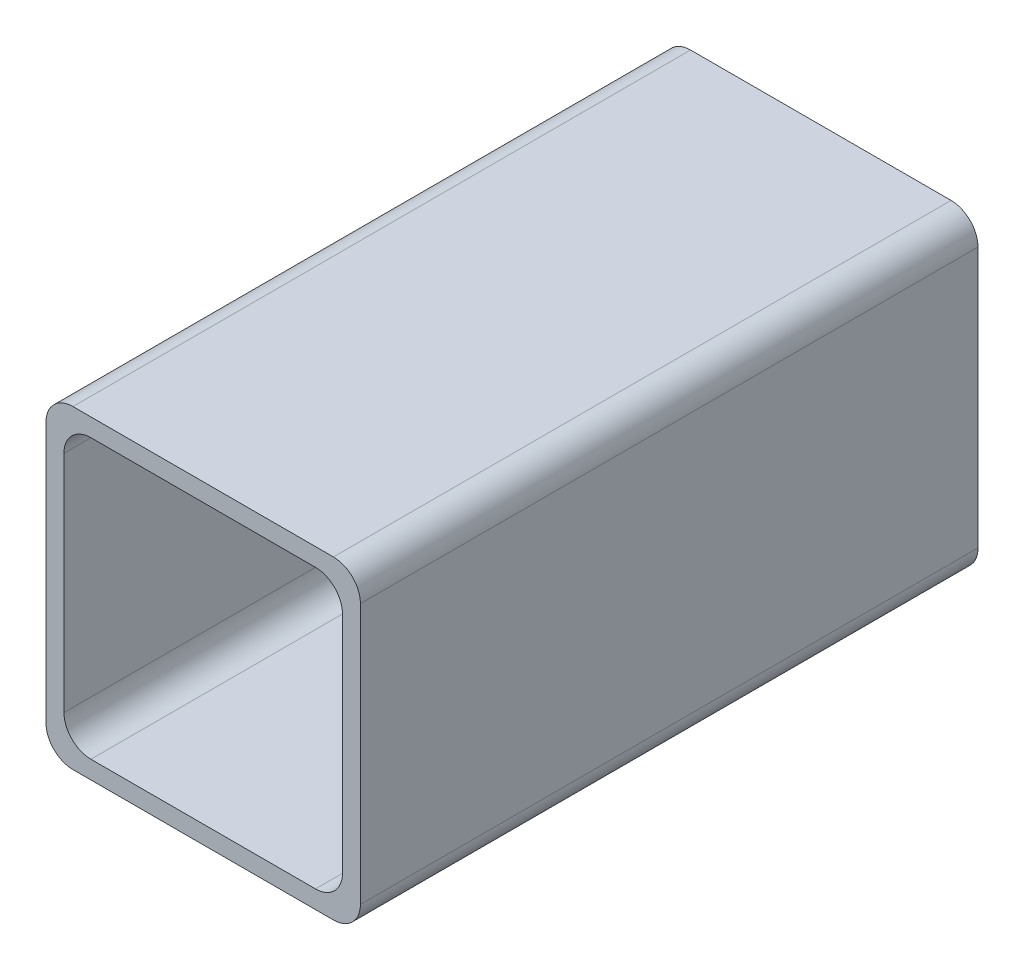
ISO-10303-21;
HEADER;
FILE_DESCRIPTION(('STEP AP214'),'2;1');
FILE_NAME('part.step','',(''),(''),'','','');
FILE_SCHEMA(('AUTOMOTIVE_DESIGN { 1 0 10303 214 1 1 1 1 }'));
ENDSEC;
DATA;
#1=APPLICATION_CONTEXT('core data for automotive mechanical design processes');
#2=APPLICATION_PROTOCOL_DEFINITION('international standard','automotive_design',2000,#1);
#3=PRODUCT_CONTEXT('',#1,'mechanical');
#4=PRODUCT('Part','Part','',(#3));
#5=PRODUCT_RELATED_PRODUCT_CATEGORY('part','',(#4));
#6=PRODUCT_DEFINITION_FORMATION('','',#4);
#7=PRODUCT_DEFINITION_CONTEXT('part definition',#1,'design');
#8=PRODUCT_DEFINITION('design','',#6,#7);
#9=PRODUCT_DEFINITION_SHAPE('','',#8);
#10=(LENGTH_UNIT() NAMED_UNIT(*) SI_UNIT(.MILLI.,.METRE.));
#11=(NAMED_UNIT(*) PLANE_ANGLE_UNIT() SI_UNIT($,.RADIAN.));
#12=(NAMED_UNIT(*) SI_UNIT($,.STERADIAN.) SOLID_ANGLE_UNIT());
#13=UNCERTAINTY_MEASURE_WITH_UNIT(LENGTH_MEASURE(1.E-05),#10,'distance_accuracy_value','');
#14=(GEOMETRIC_REPRESENTATION_CONTEXT(3) GLOBAL_UNCERTAINTY_ASSIGNED_CONTEXT((#13)) GLOBAL_UNIT_ASSIGNED_CONTEXT((#10,
#11,#12)) REPRESENTATION_CONTEXT('',''));
#15=CARTESIAN_POINT('',(0.,0.,0.));
#16=DIRECTION('',(0.,0.,1.));
#17=DIRECTION('',(1.,0.,0.));
#18=AXIS2_PLACEMENT_3D('',#15,#16,#17);
#19=CARTESIAN_POINT('',(-17.5,14.5000000000001,118.247474683058));
#20=DIRECTION('',(1.,0.,0.));
#21=DIRECTION('',(0.,0.,-1.));
#22=AXIS2_PLACEMENT_3D('',#19,#20,#21);
#23=PLANE('',#22);
#24=DIRECTION('',(0.,-1.,0.));
#25=VECTOR('',#24,1.);
#26=CARTESIAN_POINT('',(-17.5,14.5000000000002,68.7499999999999));
#27=LINE('',#26,#25);
#28=CARTESIAN_POINT('',(-17.5,14.5000000000002,68.7499999999999));
#29=VERTEX_POINT('',#28);
#30=CARTESIAN_POINT('',(-17.5,-14.4999999999998,68.7499999999999));
#31=VERTEX_POINT('',#30);
#32=EDGE_CURVE('E303',#29,#31,#27,.T.);
#33=ORIENTED_EDGE('',*,*,#32,.F.);
#34=DIRECTION('',(0.,0.,-1.));
#35=VECTOR('',#34,1.);
#36=CARTESIAN_POINT('',(-17.5,14.5000000000001,118.247474683058));
#37=LINE('',#36,#35);
#38=CARTESIAN_POINT('',(-17.5,14.5,0.));
#39=VERTEX_POINT('',#38);
#40=EDGE_CURVE('E47',#29,#39,#37,.T.);
#41=ORIENTED_EDGE('',*,*,#40,.T.);
#42=DIRECTION('',(0.,-1.,0.));
#43=VECTOR('',#42,1.);
#44=CARTESIAN_POINT('',(-17.5,14.5,0.));
#45=LINE('',#44,#43);
#46=CARTESIAN_POINT('',(-17.5,-14.5,0.));
#47=VERTEX_POINT('',#46);
#48=EDGE_CURVE('E198',#39,#47,#45,.T.);
#49=ORIENTED_EDGE('',*,*,#48,.T.);
#50=DIRECTION('',(0.,0.,-1.));
#51=VECTOR('',#50,1.);
#52=CARTESIAN_POINT('',(-17.5,-14.4999999999999,118.247474683058));
#53=LINE('',#52,#51);
#54=EDGE_CURVE('E201',#31,#47,#53,.T.);
#55=ORIENTED_EDGE('',*,*,#54,.F.);
#56=EDGE_LOOP('',(#33,#41,#49,#55));
#57=FACE_BOUND('',#56,.T.);
#58=ADVANCED_FACE('F32',(#57),#23,.F.);
#59=CARTESIAN_POINT('',(-14.5,14.5000000000001,118.247474683058));
#60=DIRECTION('',(0.,0.,-1.));
#61=DIRECTION('',(-1.,0.,0.));
#62=AXIS2_PLACEMENT_3D('',#59,#60,#61);
#63=CYLINDRICAL_SURFACE('',#62,3.);
#64=CARTESIAN_POINT('',(-14.5,14.5000000000002,68.7499999999999));
#65=DIRECTION('',(0.,0.,1.));
#66=DIRECTION('',(1.,0.,0.));
#67=AXIS2_PLACEMENT_3D('',#64,#65,#66);
#68=CIRCLE('',#67,3.);
#69=CARTESIAN_POINT('',(-14.5000000000002,17.5000000000002,68.7499999999999));
#70=VERTEX_POINT('',#69);
#71=EDGE_CURVE('E239',#70,#29,#68,.T.);
#72=ORIENTED_EDGE('',*,*,#71,.F.);
#73=DIRECTION('',(0.,0.,-1.));
#74=VECTOR('',#73,1.);
#75=CARTESIAN_POINT('',(-14.5000000000002,17.5000000000001,118.247474683058));
#76=LINE('',#75,#74);
#77=CARTESIAN_POINT('',(-14.5000000000002,17.5,0.));
#78=VERTEX_POINT('',#77);
#79=EDGE_CURVE('E204',#70,#78,#76,.T.);
#80=ORIENTED_EDGE('',*,*,#79,.T.);
#81=CARTESIAN_POINT('',(-14.5,14.5,0.));
#82=DIRECTION('',(0.,0.,1.));
#83=DIRECTION('',(1.,0.,0.));
#84=AXIS2_PLACEMENT_3D('',#81,#82,#83);
#85=CIRCLE('',#84,3.);
#86=EDGE_CURVE('E196',#78,#39,#85,.T.);
#87=ORIENTED_EDGE('',*,*,#86,.T.);
#88=ORIENTED_EDGE('',*,*,#40,.F.);
#89=EDGE_LOOP('',(#72,#80,#87,#88));
#90=FACE_BOUND('',#89,.T.);
#91=ADVANCED_FACE('F236',(#90),#63,.T.);
#92=CARTESIAN_POINT('',(14.4999999999998,17.5000000000001,118.247474683058));
#93=DIRECTION('',(0.,-1.,0.));
#94=DIRECTION('',(0.,0.,-1.));
#95=AXIS2_PLACEMENT_3D('',#92,#93,#94);
#96=PLANE('',#95);
#97=DIRECTION('',(-1.,0.,0.));
#98=VECTOR('',#97,1.);
#99=CARTESIAN_POINT('',(14.5,17.5000000000002,68.7499999999999));
#100=LINE('',#99,#98);
#101=CARTESIAN_POINT('',(14.5,17.5000000000002,68.7499999999999));
#102=VERTEX_POINT('',#101);
#103=EDGE_CURVE('E244',#102,#70,#100,.T.);
#104=ORIENTED_EDGE('',*,*,#103,.F.);
#105=DIRECTION('',(0.,0.,-1.));
#106=VECTOR('',#105,1.);
#107=CARTESIAN_POINT('',(14.4999999999998,17.5000000000001,118.247474683058));
#108=LINE('',#107,#106);
#109=CARTESIAN_POINT('',(14.4999999999998,17.5,0.));
#110=VERTEX_POINT('',#109);
#111=EDGE_CURVE('E206',#102,#110,#108,.T.);
#112=ORIENTED_EDGE('',*,*,#111,.T.);
#113=DIRECTION('',(-1.,0.,0.));
#114=VECTOR('',#113,1.);
#115=CARTESIAN_POINT('',(14.4999999999998,17.5,0.));
#116=LINE('',#115,#114);
#117=EDGE_CURVE('E193',#110,#78,#116,.T.);
#118=ORIENTED_EDGE('',*,*,#117,.T.);
#119=ORIENTED_EDGE('',*,*,#79,.F.);
#120=EDGE_LOOP('',(#104,#112,#118,#119));
#121=FACE_BOUND('',#120,.T.);
#122=ADVANCED_FACE('F242',(#121),#96,.F.);
#123=CARTESIAN_POINT('',(14.5,14.5000000000001,118.247474683058));
#124=DIRECTION('',(0.,0.,-1.));
#125=DIRECTION('',(-1.,0.,0.));
#126=AXIS2_PLACEMENT_3D('',#123,#124,#125);
#127=CYLINDRICAL_SURFACE('',#126,3.);
#128=CARTESIAN_POINT('',(14.5000000000001,14.5000000000002,68.7499999999999));
#129=DIRECTION('',(0.,0.,1.));
#130=DIRECTION('',(1.,0.,0.));
#131=AXIS2_PLACEMENT_3D('',#128,#129,#130);
#132=CIRCLE('',#131,3.);
#133=CARTESIAN_POINT('',(17.5000000000001,14.5000000000002,68.7499999999999));
#134=VERTEX_POINT('',#133);
#135=EDGE_CURVE('E307',#134,#102,#132,.T.);
#136=ORIENTED_EDGE('',*,*,#135,.F.);
#137=DIRECTION('',(0.,0.,-1.));
#138=VECTOR('',#137,1.);
#139=CARTESIAN_POINT('',(17.5,14.5000000000001,118.247474683058));
#140=LINE('',#139,#138);
#141=CARTESIAN_POINT('',(17.5,14.5,0.));
#142=VERTEX_POINT('',#141);
#143=EDGE_CURVE('E208',#134,#142,#140,.T.);
#144=ORIENTED_EDGE('',*,*,#143,.T.);
#145=CARTESIAN_POINT('',(14.5,14.5,0.));
#146=DIRECTION('',(0.,0.,1.));
#147=DIRECTION('',(-1.,0.,0.));
#148=AXIS2_PLACEMENT_3D('',#145,#146,#147);
#149=CIRCLE('',#148,3.);
#150=EDGE_CURVE('E190',#142,#110,#149,.T.);
#151=ORIENTED_EDGE('',*,*,#150,.T.);
#152=ORIENTED_EDGE('',*,*,#111,.F.);
#153=EDGE_LOOP('',(#136,#144,#151,#152));
#154=FACE_BOUND('',#153,.T.);
#155=ADVANCED_FACE('F247',(#154),#127,.T.);
#156=CARTESIAN_POINT('',(17.5,14.5000000000001,118.247474683058));
#157=DIRECTION('',(-1.,0.,0.));
#158=DIRECTION('',(0.,0.,1.));
#159=AXIS2_PLACEMENT_3D('',#156,#157,#158);
#160=PLANE('',#159);
#161=DIRECTION('',(0.,1.,0.));
#162=VECTOR('',#161,1.);
#163=CARTESIAN_POINT('',(17.5000000000001,14.5000000000002,68.7499999999999));
#164=LINE('',#163,#162);
#165=CARTESIAN_POINT('',(17.5000000000001,-14.4999999999998,68.7499999999999));
#166=VERTEX_POINT('',#165);
#167=EDGE_CURVE('E253',#166,#134,#164,.T.);
#168=ORIENTED_EDGE('',*,*,#167,.F.);
#169=DIRECTION('',(0.,0.,-1.));
#170=VECTOR('',#169,1.);
#171=CARTESIAN_POINT('',(17.5,-14.5,118.247474683058));
#172=LINE('',#171,#170);
#173=CARTESIAN_POINT('',(17.5,-14.5,0.));
#174=VERTEX_POINT('',#173);
#175=EDGE_CURVE('E210',#166,#174,#172,.T.);
#176=ORIENTED_EDGE('',*,*,#175,.T.);
#177=DIRECTION('',(0.,1.,0.));
#178=VECTOR('',#177,1.);
#179=CARTESIAN_POINT('',(17.5,14.5,0.));
#180=LINE('',#179,#178);
#181=EDGE_CURVE('E187',#174,#142,#180,.T.);
#182=ORIENTED_EDGE('',*,*,#181,.T.);
#183=ORIENTED_EDGE('',*,*,#143,.F.);
#184=EDGE_LOOP('',(#168,#176,#182,#183));
#185=FACE_BOUND('',#184,.T.);
#186=ADVANCED_FACE('F250',(#185),#160,.F.);
#187=CARTESIAN_POINT('',(14.5,-14.5,118.247474683058));
#188=DIRECTION('',(0.,0.,-1.));
#189=DIRECTION('',(-1.,0.,0.));
#190=AXIS2_PLACEMENT_3D('',#187,#188,#189);
#191=CYLINDRICAL_SURFACE('',#190,3.);
#192=CARTESIAN_POINT('',(14.5,-14.4999999999998,68.7499999999999));
#193=DIRECTION('',(0.,0.,1.));
#194=DIRECTION('',(1.,0.,0.));
#195=AXIS2_PLACEMENT_3D('',#192,#193,#194);
#196=CIRCLE('',#195,3.);
#197=CARTESIAN_POINT('',(14.5,-17.4999999999998,68.7499999999999));
#198=VERTEX_POINT('',#197);
#199=EDGE_CURVE('E257',#198,#166,#196,.T.);
#200=ORIENTED_EDGE('',*,*,#199,.F.);
#201=DIRECTION('',(0.,0.,-1.));
#202=VECTOR('',#201,1.);
#203=CARTESIAN_POINT('',(14.5,-17.5,118.247474683058));
#204=LINE('',#203,#202);
#205=CARTESIAN_POINT('',(14.5,-17.5,0.));
#206=VERTEX_POINT('',#205);
#207=EDGE_CURVE('E212',#198,#206,#204,.T.);
#208=ORIENTED_EDGE('',*,*,#207,.T.);
#209=CARTESIAN_POINT('',(14.5,-14.5,0.));
#210=DIRECTION('',(0.,0.,1.));
#211=DIRECTION('',(1.,0.,0.));
#212=AXIS2_PLACEMENT_3D('',#209,#210,#211);
#213=CIRCLE('',#212,3.);
#214=EDGE_CURVE('E184',#206,#174,#213,.T.);
#215=ORIENTED_EDGE('',*,*,#214,.T.);
#216=ORIENTED_EDGE('',*,*,#175,.F.);
#217=EDGE_LOOP('',(#200,#208,#215,#216));
#218=FACE_BOUND('',#217,.T.);
#219=ADVANCED_FACE('F256',(#218),#191,.T.);
#220=CARTESIAN_POINT('',(14.5,-17.4999999999999,118.247474683058));
#221=DIRECTION('',(0.,1.,0.));
#222=DIRECTION('',(0.,0.,1.));
#223=AXIS2_PLACEMENT_3D('',#220,#221,#222);
#224=PLANE('',#223);
#225=DIRECTION('',(1.,0.,0.));
#226=VECTOR('',#225,1.);
#227=CARTESIAN_POINT('',(14.5,-17.4999999999998,68.7499999999999));
#228=LINE('',#227,#226);
#229=CARTESIAN_POINT('',(-14.5,-17.4999999999998,68.7499999999999));
#230=VERTEX_POINT('',#229);
#231=EDGE_CURVE('E220',#230,#198,#228,.T.);
#232=ORIENTED_EDGE('',*,*,#231,.F.);
#233=DIRECTION('',(0.,0.,-1.));
#234=VECTOR('',#233,1.);
#235=CARTESIAN_POINT('',(-14.5,-17.4999999999999,118.247474683058));
#236=LINE('',#235,#234);
#237=CARTESIAN_POINT('',(-14.5,-17.5,0.));
#238=VERTEX_POINT('',#237);
#239=EDGE_CURVE('E40',#230,#238,#236,.T.);
#240=ORIENTED_EDGE('',*,*,#239,.T.);
#241=DIRECTION('',(1.,0.,0.));
#242=VECTOR('',#241,1.);
#243=CARTESIAN_POINT('',(14.5,-17.5,0.));
#244=LINE('',#243,#242);
#245=EDGE_CURVE('E181',#238,#206,#244,.T.);
#246=ORIENTED_EDGE('',*,*,#245,.T.);
#247=ORIENTED_EDGE('',*,*,#207,.F.);
#248=EDGE_LOOP('',(#232,#240,#246,#247));
#249=FACE_BOUND('',#248,.T.);
#250=ADVANCED_FACE('F216',(#249),#224,.F.);
#251=CARTESIAN_POINT('',(-14.5,-14.4999999999999,118.247474683058));
#252=DIRECTION('',(0.,0.,-1.));
#253=DIRECTION('',(-1.,0.,0.));
#254=AXIS2_PLACEMENT_3D('',#251,#252,#253);
#255=CYLINDRICAL_SURFACE('',#254,3.);
#256=CARTESIAN_POINT('',(-14.5,-14.4999999999998,68.7499999999999));
#257=DIRECTION('',(0.,0.,1.));
#258=DIRECTION('',(1.,0.,0.));
#259=AXIS2_PLACEMENT_3D('',#256,#257,#258);
#260=CIRCLE('',#259,3.);
#261=EDGE_CURVE('E230',#31,#230,#260,.T.);
#262=ORIENTED_EDGE('',*,*,#261,.F.);
#263=ORIENTED_EDGE('',*,*,#54,.T.);
#264=CARTESIAN_POINT('',(-14.5,-14.5,0.));
#265=DIRECTION('',(0.,0.,1.));
#266=DIRECTION('',(-1.,0.,0.));
#267=AXIS2_PLACEMENT_3D('',#264,#265,#266);
#268=CIRCLE('',#267,3.);
#269=EDGE_CURVE('E178',#47,#238,#268,.T.);
#270=ORIENTED_EDGE('',*,*,#269,.T.);
#271=ORIENTED_EDGE('',*,*,#239,.F.);
#272=EDGE_LOOP('',(#262,#263,#270,#271));
#273=FACE_BOUND('',#272,.T.);
#274=ADVANCED_FACE('F34',(#273),#255,.T.);
#275=CARTESIAN_POINT('',(-14.5,-14.5,0.));
#276=DIRECTION('',(0.,0.,-1.));
#277=DIRECTION('',(-1.,0.,0.));
#278=AXIS2_PLACEMENT_3D('',#275,#276,#277);
#279=PLANE('',#278);
#280=ORIENTED_EDGE('',*,*,#269,.F.);
#281=ORIENTED_EDGE('',*,*,#48,.F.);
#282=ORIENTED_EDGE('',*,*,#86,.F.);
#283=ORIENTED_EDGE('',*,*,#117,.F.);
#284=ORIENTED_EDGE('',*,*,#150,.F.);
#285=ORIENTED_EDGE('',*,*,#181,.F.);
#286=ORIENTED_EDGE('',*,*,#214,.F.);
#287=ORIENTED_EDGE('',*,*,#245,.F.);
#288=EDGE_LOOP('',(#280,#281,#282,#283,#284,#285,#286,#287));
#289=FACE_BOUND('',#288,.T.);
#290=DIRECTION('',(-1.,0.,0.));
#291=VECTOR('',#290,1.);
#292=CARTESIAN_POINT('',(-12.5,15.5,0.));
#293=LINE('',#292,#291);
#294=CARTESIAN_POINT('',(12.5,15.5,0.));
#295=VERTEX_POINT('',#294);
#296=CARTESIAN_POINT('',(-12.5,15.5,0.));
#297=VERTEX_POINT('',#296);
#298=EDGE_CURVE('E160',#295,#297,#293,.T.);
#299=ORIENTED_EDGE('',*,*,#298,.T.);
#300=CARTESIAN_POINT('',(-12.5,12.5,0.));
#301=DIRECTION('',(0.,0.,1.));
#302=DIRECTION('',(-1.,0.,0.));
#303=AXIS2_PLACEMENT_3D('',#300,#301,#302);
#304=CIRCLE('',#303,3.);
#305=CARTESIAN_POINT('',(-15.5,12.5,0.));
#306=VERTEX_POINT('',#305);
#307=EDGE_CURVE('E259',#297,#306,#304,.T.);
#308=ORIENTED_EDGE('',*,*,#307,.T.);
#309=DIRECTION('',(0.,-1.,0.));
#310=VECTOR('',#309,1.);
#311=CARTESIAN_POINT('',(-15.5,-12.5,0.));
#312=LINE('',#311,#310);
#313=CARTESIAN_POINT('',(-15.5,-12.5,0.));
#314=VERTEX_POINT('',#313);
#315=EDGE_CURVE('E266',#306,#314,#312,.T.);
#316=ORIENTED_EDGE('',*,*,#315,.T.);
#317=CARTESIAN_POINT('',(-12.5,-12.5,0.));
#318=DIRECTION('',(0.,0.,1.));
#319=DIRECTION('',(1.,0.,0.));
#320=AXIS2_PLACEMENT_3D('',#317,#318,#319);
#321=CIRCLE('',#320,3.);
#322=CARTESIAN_POINT('',(-12.5,-15.5,0.));
#323=VERTEX_POINT('',#322);
#324=EDGE_CURVE('E269',#314,#323,#321,.T.);
#325=ORIENTED_EDGE('',*,*,#324,.T.);
#326=DIRECTION('',(1.,0.,0.));
#327=VECTOR('',#326,1.);
#328=CARTESIAN_POINT('',(-12.5,-15.5,0.));
#329=LINE('',#328,#327);
#330=CARTESIAN_POINT('',(12.5,-15.5,0.));
#331=VERTEX_POINT('',#330);
#332=EDGE_CURVE('E272',#323,#331,#329,.T.);
#333=ORIENTED_EDGE('',*,*,#332,.T.);
#334=CARTESIAN_POINT('',(12.5,-12.5,0.));
#335=DIRECTION('',(0.,0.,1.));
#336=DIRECTION('',(-1.,0.,0.));
#337=AXIS2_PLACEMENT_3D('',#334,#335,#336);
#338=CIRCLE('',#337,3.);
#339=CARTESIAN_POINT('',(15.5,-12.5,0.));
#340=VERTEX_POINT('',#339);
#341=EDGE_CURVE('E275',#331,#340,#338,.T.);
#342=ORIENTED_EDGE('',*,*,#341,.T.);
#343=DIRECTION('',(0.,1.,0.));
#344=VECTOR('',#343,1.);
#345=CARTESIAN_POINT('',(15.5,-12.5,0.));
#346=LINE('',#345,#344);
#347=CARTESIAN_POINT('',(15.5,12.5,0.));
#348=VERTEX_POINT('',#347);
#349=EDGE_CURVE('E278',#340,#348,#346,.T.);
#350=ORIENTED_EDGE('',*,*,#349,.T.);
#351=CARTESIAN_POINT('',(12.5,12.5,0.));
#352=DIRECTION('',(0.,0.,1.));
#353=DIRECTION('',(1.,0.,0.));
#354=AXIS2_PLACEMENT_3D('',#351,#352,#353);
#355=CIRCLE('',#354,3.);
#356=EDGE_CURVE('E281',#348,#295,#355,.T.);
#357=ORIENTED_EDGE('',*,*,#356,.T.);
#358=EDGE_LOOP('',(#299,#308,#316,#325,#333,#342,#350,#357));
#359=FACE_BOUND('',#358,.T.);
#360=ADVANCED_FACE('F226',(#289,#359),#279,.T.);
#361=CARTESIAN_POINT('',(-12.5,15.5000000000001,118.247474683058));
#362=DIRECTION('',(0.,-1.,0.));
#363=DIRECTION('',(0.,0.,-1.));
#364=AXIS2_PLACEMENT_3D('',#361,#362,#363);
#365=PLANE('',#364);
#366=DIRECTION('',(0.,0.,-1.));
#367=VECTOR('',#366,1.);
#368=CARTESIAN_POINT('',(12.5,15.5000000000001,118.247474683058));
#369=LINE('',#368,#367);
#370=CARTESIAN_POINT('',(12.5000000000001,15.5000000000002,68.7499999999999));
#371=VERTEX_POINT('',#370);
#372=EDGE_CURVE('E152',#371,#295,#369,.T.);
#373=ORIENTED_EDGE('',*,*,#372,.F.);
#374=DIRECTION('',(-1.,0.,0.));
#375=VECTOR('',#374,1.);
#376=CARTESIAN_POINT('',(-12.5,15.5000000000002,68.7499999999998));
#377=LINE('',#376,#375);
#378=CARTESIAN_POINT('',(-12.5,15.5000000000002,68.7499999999998));
#379=VERTEX_POINT('',#378);
#380=EDGE_CURVE('E11',#371,#379,#377,.T.);
#381=ORIENTED_EDGE('',*,*,#380,.T.);
#382=DIRECTION('',(0.,0.,-1.));
#383=VECTOR('',#382,1.);
#384=CARTESIAN_POINT('',(-12.5,15.5000000000001,118.247474683058));
#385=LINE('',#384,#383);
#386=EDGE_CURVE('E162',#379,#297,#385,.T.);
#387=ORIENTED_EDGE('',*,*,#386,.T.);
#388=ORIENTED_EDGE('',*,*,#298,.F.);
#389=EDGE_LOOP('',(#373,#381,#387,#388));
#390=FACE_BOUND('',#389,.T.);
#391=ADVANCED_FACE('F158',(#390),#365,.T.);
#392=CARTESIAN_POINT('',(12.5,12.5000000000001,118.247474683058));
#393=DIRECTION('',(0.,0.,-1.));
#394=DIRECTION('',(-1.,0.,0.));
#395=AXIS2_PLACEMENT_3D('',#392,#393,#394);
#396=CYLINDRICAL_SURFACE('',#395,3.);
#397=DIRECTION('',(0.,0.,-1.));
#398=VECTOR('',#397,1.);
#399=CARTESIAN_POINT('',(15.5,12.5000000000001,118.247474683058));
#400=LINE('',#399,#398);
#401=CARTESIAN_POINT('',(15.5000000000001,12.5000000000002,68.75));
#402=VERTEX_POINT('',#401);
#403=EDGE_CURVE('E154',#402,#348,#400,.T.);
#404=ORIENTED_EDGE('',*,*,#403,.F.);
#405=CARTESIAN_POINT('',(12.5000000000001,12.5000000000002,68.75));
#406=DIRECTION('',(0.,0.,1.));
#407=DIRECTION('',(1.,0.,0.));
#408=AXIS2_PLACEMENT_3D('',#405,#406,#407);
#409=CIRCLE('',#408,3.);
#410=EDGE_CURVE('E145',#402,#371,#409,.T.);
#411=ORIENTED_EDGE('',*,*,#410,.T.);
#412=ORIENTED_EDGE('',*,*,#372,.T.);
#413=ORIENTED_EDGE('',*,*,#356,.F.);
#414=EDGE_LOOP('',(#404,#411,#412,#413));
#415=FACE_BOUND('',#414,.T.);
#416=ADVANCED_FACE('F150',(#415),#396,.F.);
#417=CARTESIAN_POINT('',(15.5,-12.5,118.247474683058));
#418=DIRECTION('',(-1.,0.,0.));
#419=DIRECTION('',(0.,0.,1.));
#420=AXIS2_PLACEMENT_3D('',#417,#418,#419);
#421=PLANE('',#420);
#422=DIRECTION('',(0.,0.,-1.));
#423=VECTOR('',#422,1.);
#424=CARTESIAN_POINT('',(15.5,-12.5,118.247474683058));
#425=LINE('',#424,#423);
#426=CARTESIAN_POINT('',(15.5,-12.4999999999998,68.7499999999999));
#427=VERTEX_POINT('',#426);
#428=EDGE_CURVE('E164',#427,#340,#425,.T.);
#429=ORIENTED_EDGE('',*,*,#428,.F.);
#430=DIRECTION('',(0.,1.,0.));
#431=VECTOR('',#430,1.);
#432=CARTESIAN_POINT('',(15.5,-12.4999999999998,68.7499999999999));
#433=LINE('',#432,#431);
#434=EDGE_CURVE('E156',#427,#402,#433,.T.);
#435=ORIENTED_EDGE('',*,*,#434,.T.);
#436=ORIENTED_EDGE('',*,*,#403,.T.);
#437=ORIENTED_EDGE('',*,*,#349,.F.);
#438=EDGE_LOOP('',(#429,#435,#436,#437));
#439=FACE_BOUND('',#438,.T.);
#440=ADVANCED_FACE('F287',(#439),#421,.T.);
#441=CARTESIAN_POINT('',(12.5,-12.5,118.247474683058));
#442=DIRECTION('',(0.,0.,-1.));
#443=DIRECTION('',(-1.,0.,0.));
#444=AXIS2_PLACEMENT_3D('',#441,#442,#443);
#445=CYLINDRICAL_SURFACE('',#444,3.);
#446=DIRECTION('',(0.,0.,-1.));
#447=VECTOR('',#446,1.);
#448=CARTESIAN_POINT('',(12.5,-15.5,118.247474683058));
#449=LINE('',#448,#447);
#450=CARTESIAN_POINT('',(12.5,-15.4999999999998,68.75));
#451=VERTEX_POINT('',#450);
#452=EDGE_CURVE('E170',#451,#331,#449,.T.);
#453=ORIENTED_EDGE('',*,*,#452,.F.);
#454=CARTESIAN_POINT('',(12.5,-12.4999999999998,68.75));
#455=DIRECTION('',(0.,0.,1.));
#456=DIRECTION('',(1.,0.,0.));
#457=AXIS2_PLACEMENT_3D('',#454,#455,#456);
#458=CIRCLE('',#457,3.);
#459=EDGE_CURVE('E289',#451,#427,#458,.T.);
#460=ORIENTED_EDGE('',*,*,#459,.T.);
#461=ORIENTED_EDGE('',*,*,#428,.T.);
#462=ORIENTED_EDGE('',*,*,#341,.F.);
#463=EDGE_LOOP('',(#453,#460,#461,#462));
#464=FACE_BOUND('',#463,.T.);
#465=ADVANCED_FACE('F324',(#464),#445,.F.);
#466=CARTESIAN_POINT('',(-12.5,-15.4999999999998,118.247474683058));
#467=DIRECTION('',(0.,1.,0.));
#468=DIRECTION('',(0.,0.,1.));
#469=AXIS2_PLACEMENT_3D('',#466,#467,#468);
#470=PLANE('',#469);
#471=DIRECTION('',(0.,0.,-1.));
#472=VECTOR('',#471,1.);
#473=CARTESIAN_POINT('',(-12.5,-15.4999999999998,118.247474683058));
#474=LINE('',#473,#472);
#475=CARTESIAN_POINT('',(-12.5,-15.4999999999998,68.75));
#476=VERTEX_POINT('',#475);
#477=EDGE_CURVE('E172',#476,#323,#474,.T.);
#478=ORIENTED_EDGE('',*,*,#477,.F.);
#479=DIRECTION('',(1.,0.,0.));
#480=VECTOR('',#479,1.);
#481=CARTESIAN_POINT('',(-12.5,-15.4999999999998,68.75));
#482=LINE('',#481,#480);
#483=EDGE_CURVE('E291',#476,#451,#482,.T.);
#484=ORIENTED_EDGE('',*,*,#483,.T.);
#485=ORIENTED_EDGE('',*,*,#452,.T.);
#486=ORIENTED_EDGE('',*,*,#332,.F.);
#487=EDGE_LOOP('',(#478,#484,#485,#486));
#488=FACE_BOUND('',#487,.T.);
#489=ADVANCED_FACE('F321',(#488),#470,.T.);
#490=CARTESIAN_POINT('',(-12.5,-12.4999999999999,118.247474683058));
#491=DIRECTION('',(0.,0.,-1.));
#492=DIRECTION('',(-1.,0.,0.));
#493=AXIS2_PLACEMENT_3D('',#490,#491,#492);
#494=CYLINDRICAL_SURFACE('',#493,3.);
#495=DIRECTION('',(0.,0.,-1.));
#496=VECTOR('',#495,1.);
#497=CARTESIAN_POINT('',(-15.5,-12.4999999999999,118.247474683058));
#498=LINE('',#497,#496);
#499=CARTESIAN_POINT('',(-15.5,-12.4999999999998,68.7499999999999));
#500=VERTEX_POINT('',#499);
#501=EDGE_CURVE('E174',#500,#314,#498,.T.);
#502=ORIENTED_EDGE('',*,*,#501,.F.);
#503=CARTESIAN_POINT('',(-12.5,-12.4999999999998,68.75));
#504=DIRECTION('',(0.,0.,1.));
#505=DIRECTION('',(1.,0.,0.));
#506=AXIS2_PLACEMENT_3D('',#503,#504,#505);
#507=CIRCLE('',#506,3.);
#508=EDGE_CURVE('E296',#500,#476,#507,.T.);
#509=ORIENTED_EDGE('',*,*,#508,.T.);
#510=ORIENTED_EDGE('',*,*,#477,.T.);
#511=ORIENTED_EDGE('',*,*,#324,.F.);
#512=EDGE_LOOP('',(#502,#509,#510,#511));
#513=FACE_BOUND('',#512,.T.);
#514=ADVANCED_FACE('F318',(#513),#494,.F.);
#515=CARTESIAN_POINT('',(-15.5,-12.4999999999999,118.247474683058));
#516=DIRECTION('',(1.,0.,0.));
#517=DIRECTION('',(0.,0.,-1.));
#518=AXIS2_PLACEMENT_3D('',#515,#516,#517);
#519=PLANE('',#518);
#520=DIRECTION('',(0.,0.,-1.));
#521=VECTOR('',#520,1.);
#522=CARTESIAN_POINT('',(-15.5,12.5000000000001,118.247474683058));
#523=LINE('',#522,#521);
#524=CARTESIAN_POINT('',(-15.5,12.5000000000002,68.75));
#525=VERTEX_POINT('',#524);
#526=EDGE_CURVE('E176',#525,#306,#523,.T.);
#527=ORIENTED_EDGE('',*,*,#526,.F.);
#528=DIRECTION('',(0.,-1.,0.));
#529=VECTOR('',#528,1.);
#530=CARTESIAN_POINT('',(-15.5,-12.4999999999998,68.7499999999999));
#531=LINE('',#530,#529);
#532=EDGE_CURVE('E299',#525,#500,#531,.T.);
#533=ORIENTED_EDGE('',*,*,#532,.T.);
#534=ORIENTED_EDGE('',*,*,#501,.T.);
#535=ORIENTED_EDGE('',*,*,#315,.F.);
#536=EDGE_LOOP('',(#527,#533,#534,#535));
#537=FACE_BOUND('',#536,.T.);
#538=ADVANCED_FACE('F313',(#537),#519,.T.);
#539=CARTESIAN_POINT('',(-12.5,12.5000000000001,118.247474683058));
#540=DIRECTION('',(0.,0.,-1.));
#541=DIRECTION('',(-1.,0.,0.));
#542=AXIS2_PLACEMENT_3D('',#539,#540,#541);
#543=CYLINDRICAL_SURFACE('',#542,3.);
#544=ORIENTED_EDGE('',*,*,#386,.F.);
#545=CARTESIAN_POINT('',(-12.5,12.5000000000002,68.75));
#546=DIRECTION('',(0.,0.,1.));
#547=DIRECTION('',(1.,0.,0.));
#548=AXIS2_PLACEMENT_3D('',#545,#546,#547);
#549=CIRCLE('',#548,3.);
#550=EDGE_CURVE('E55',#379,#525,#549,.T.);
#551=ORIENTED_EDGE('',*,*,#550,.T.);
#552=ORIENTED_EDGE('',*,*,#526,.T.);
#553=ORIENTED_EDGE('',*,*,#307,.F.);
#554=EDGE_LOOP('',(#544,#551,#552,#553));
#555=FACE_BOUND('',#554,.T.);
#556=ADVANCED_FACE('F309',(#555),#543,.F.);
#557=CARTESIAN_POINT('',(0.,2.22044604925031E-13,68.7499999999999));
#558=DIRECTION('',(0.,0.,1.));
#559=DIRECTION('',(0.99936665420733,0.0355849751784164,0.));
#560=AXIS2_PLACEMENT_3D('',#557,#558,#559);
#561=PLANE('',#560);
#562=ORIENTED_EDGE('',*,*,#550,.F.);
#563=ORIENTED_EDGE('',*,*,#380,.F.);
#564=ORIENTED_EDGE('',*,*,#410,.F.);
#565=ORIENTED_EDGE('',*,*,#434,.F.);
#566=ORIENTED_EDGE('',*,*,#459,.F.);
#567=ORIENTED_EDGE('',*,*,#483,.F.);
#568=ORIENTED_EDGE('',*,*,#508,.F.);
#569=ORIENTED_EDGE('',*,*,#532,.F.);
#570=EDGE_LOOP('',(#562,#563,#564,#565,#566,#567,#568,#569));
#571=FACE_BOUND('',#570,.T.);
#572=ORIENTED_EDGE('',*,*,#32,.T.);
#573=ORIENTED_EDGE('',*,*,#261,.T.);
#574=ORIENTED_EDGE('',*,*,#231,.T.);
#575=ORIENTED_EDGE('',*,*,#199,.T.);
#576=ORIENTED_EDGE('',*,*,#167,.T.);
#577=ORIENTED_EDGE('',*,*,#135,.T.);
#578=ORIENTED_EDGE('',*,*,#103,.T.);
#579=ORIENTED_EDGE('',*,*,#71,.T.);
#580=EDGE_LOOP('',(#572,#573,#574,#575,#576,#577,#578,#579));
#581=FACE_BOUND('',#580,.T.);
#582=ADVANCED_FACE('F143',(#571,#581),#561,.T.);
#583=CLOSED_SHELL('',(#58,#91,#122,#155,#186,#219,#250,#274,#360,#391,#416,#440,#465,#489,#514,
#538,#556,#582));
#584=MANIFOLD_SOLID_BREP('B2',#583);
#585=ADVANCED_BREP_SHAPE_REPRESENTATION('',(#18,#584),#14);
#586=SHAPE_DEFINITION_REPRESENTATION(#9,#585);
ENDSEC;
END-ISO-10303-21;
